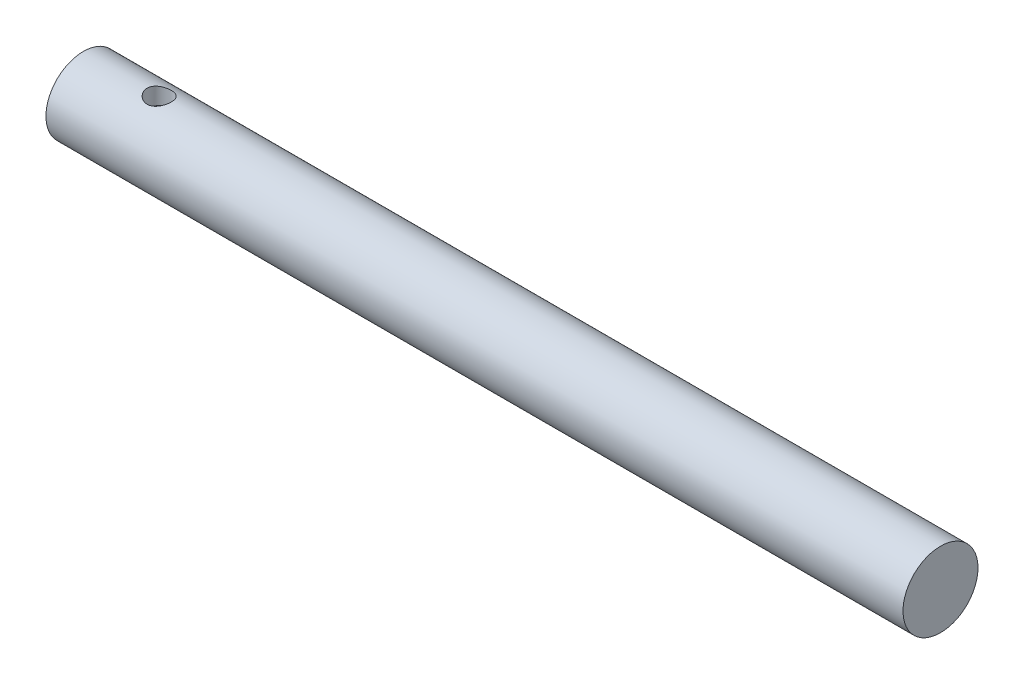
ISO-10303-21;
HEADER;
FILE_DESCRIPTION(('STEP AP214'),'2;1');
FILE_NAME('part.step','',(''),(''),'','','');
FILE_SCHEMA(('AUTOMOTIVE_DESIGN { 1 0 10303 214 1 1 1 1 }'));
ENDSEC;
DATA;
#1=APPLICATION_CONTEXT('core data for automotive mechanical design processes');
#2=APPLICATION_PROTOCOL_DEFINITION('international standard','automotive_design',2000,#1);
#3=PRODUCT_CONTEXT('',#1,'mechanical');
#4=PRODUCT('Part','Part','',(#3));
#5=PRODUCT_RELATED_PRODUCT_CATEGORY('part','',(#4));
#6=PRODUCT_DEFINITION_FORMATION('','',#4);
#7=PRODUCT_DEFINITION_CONTEXT('part definition',#1,'design');
#8=PRODUCT_DEFINITION('design','',#6,#7);
#9=PRODUCT_DEFINITION_SHAPE('','',#8);
#10=(LENGTH_UNIT() NAMED_UNIT(*) SI_UNIT(.MILLI.,.METRE.));
#11=(NAMED_UNIT(*) PLANE_ANGLE_UNIT() SI_UNIT($,.RADIAN.));
#12=(NAMED_UNIT(*) SI_UNIT($,.STERADIAN.) SOLID_ANGLE_UNIT());
#13=UNCERTAINTY_MEASURE_WITH_UNIT(LENGTH_MEASURE(1.E-05),#10,'distance_accuracy_value','');
#14=(GEOMETRIC_REPRESENTATION_CONTEXT(3) GLOBAL_UNCERTAINTY_ASSIGNED_CONTEXT((#13)) GLOBAL_UNIT_ASSIGNED_CONTEXT((#10,
#11,#12)) REPRESENTATION_CONTEXT('',''));
#15=CARTESIAN_POINT('',(0.,0.,0.));
#16=DIRECTION('',(0.,0.,1.));
#17=DIRECTION('',(1.,0.,0.));
#18=AXIS2_PLACEMENT_3D('',#15,#16,#17);
#19=CARTESIAN_POINT('',(71.12,0.,0.));
#20=DIRECTION('',(-1.,0.,0.));
#21=DIRECTION('',(0.,0.,1.));
#22=AXIS2_PLACEMENT_3D('',#19,#20,#21);
#23=CYLINDRICAL_SURFACE('',#22,3.1115);
#24=CARTESIAN_POINT('',(6.28856363377193,2.94642703116843,-1.));
#25=CARTESIAN_POINT('',(6.34315367775352,2.94642717018856,-0.999999880581601));
#26=CARTESIAN_POINT('',(6.39774526324955,2.94796075388296,-0.995514738402349));
#27=CARTESIAN_POINT('',(6.50531892689581,2.95390029986224,-0.977747819684249));
#28=CARTESIAN_POINT('',(6.55830064018965,2.95830690827301,-0.964464064379803));
#29=CARTESIAN_POINT('',(6.6610800479492,2.96944295679219,-0.929608413053124));
#30=CARTESIAN_POINT('',(6.710883431207,2.97616810048008,-0.90805183888401));
#31=CARTESIAN_POINT('',(6.80618163875692,2.9911773789918,-0.857314108506713));
#32=CARTESIAN_POINT('',(6.85167561784252,2.99946181869368,-0.828131460792548));
#33=CARTESIAN_POINT('',(6.93871723131713,3.01699397258492,-0.761833873233638));
#34=CARTESIAN_POINT('',(6.98008525994176,3.02626444308841,-0.724489091650055));
#35=CARTESIAN_POINT('',(7.0560925797304,3.04453102136603,-0.643418590957716));
#36=CARTESIAN_POINT('',(7.09073087384111,3.05352708831933,-0.599691928010366));
#37=CARTESIAN_POINT('',(7.15309738524942,3.07049288024779,-0.505798702368883));
#38=CARTESIAN_POINT('',(7.18063928592378,3.07843270229025,-0.455502503969951));
#39=CARTESIAN_POINT('',(7.22680194419123,3.09212466343625,-0.350692757435096));
#40=CARTESIAN_POINT('',(7.2454249268308,3.09787734810183,-0.296180265104571));
#41=CARTESIAN_POINT('',(7.27261749712343,3.10638574279742,-0.186366991441238));
#42=CARTESIAN_POINT('',(7.28149435637244,3.10923283956774,-0.131149509646918));
#43=CARTESIAN_POINT('',(7.28991770845223,3.11193271467309,-0.0199403580659783));
#44=CARTESIAN_POINT('',(7.28946644102113,3.11178621178912,0.0360511226524476));
#45=CARTESIAN_POINT('',(7.27944545286807,3.10857831369005,0.145051121583793));
#46=CARTESIAN_POINT('',(7.27020909658398,3.10562348794371,0.198093930553713));
#47=CARTESIAN_POINT('',(7.24342890581667,3.09726316478814,0.301832237882419));
#48=CARTESIAN_POINT('',(7.22588451973183,3.09185750465973,0.352527580138608));
#49=CARTESIAN_POINT('',(7.18278038641475,3.0790629368361,0.450884115299431));
#50=CARTESIAN_POINT('',(7.15712213665836,3.07164982664454,0.498498861872665));
#51=CARTESIAN_POINT('',(7.09859851639436,3.05561748880042,0.588848482360886));
#52=CARTESIAN_POINT('',(7.0657312447591,3.04699794321006,0.631582064509975));
#53=CARTESIAN_POINT('',(6.9920241617242,3.02901938073325,0.712942327359244));
#54=CARTESIAN_POINT('',(6.95089743040982,3.01964451366678,0.751305944879454));
#55=CARTESIAN_POINT('',(6.86270961783881,3.00153570693509,0.820672983731542));
#56=CARTESIAN_POINT('',(6.81564775223341,2.99280185222366,0.85167543069507));
#57=CARTESIAN_POINT('',(6.716144653928,2.97688107731568,0.90577013805172));
#58=CARTESIAN_POINT('',(6.66364384383496,2.96971472787707,0.928759319545221));
#59=CARTESIAN_POINT('',(6.55522933248398,2.95798017131937,0.96548517121944));
#60=CARTESIAN_POINT('',(6.49931695106853,2.95341096640611,0.979225395121648));
#61=CARTESIAN_POINT('',(6.38819864820245,2.9476113321464,0.996544059833803));
#62=CARTESIAN_POINT('',(6.33306275532381,2.94624794485703,1.00052746426013));
#63=CARTESIAN_POINT('',(6.22290466563879,2.94664410731836,0.999360597920425));
#64=CARTESIAN_POINT('',(6.16788245151398,2.94840313987039,0.994211839808948));
#65=CARTESIAN_POINT('',(6.06129797212999,2.95471412977537,0.975289571727774));
#66=CARTESIAN_POINT('',(6.00968131875688,2.95917738077124,0.961789718489808));
#67=CARTESIAN_POINT('',(5.90945341104933,2.97029841242403,0.92687272374307));
#68=CARTESIAN_POINT('',(5.86084266683711,2.97695656436262,0.90545424267272));
#69=CARTESIAN_POINT('',(5.7663926417185,2.99196474969366,0.854576381689205));
#70=CARTESIAN_POINT('',(5.72068014756425,3.00035952291692,0.824895178338465));
#71=CARTESIAN_POINT('',(5.63473759497611,3.01780491166552,0.758590166508191));
#72=CARTESIAN_POINT('',(5.59450904717242,3.0268557068539,0.721964451681478));
#73=CARTESIAN_POINT('',(5.51884010021471,3.04507748350012,0.640885235910722));
#74=CARTESIAN_POINT('',(5.48369002791398,3.05423608716214,0.596157246061424));
#75=CARTESIAN_POINT('',(5.42137997706582,3.07124385238374,0.501214391439224));
#76=CARTESIAN_POINT('',(5.3942196625538,3.07909306899627,0.450999757498271));
#77=CARTESIAN_POINT('',(5.34891696955919,3.09255587221059,0.346796288018459));
#78=CARTESIAN_POINT('',(5.33071160959019,3.09818501565846,0.292836948775638));
#79=CARTESIAN_POINT('',(5.30370048676371,3.10664143143312,0.182408004150389));
#80=CARTESIAN_POINT('',(5.29489159471,3.10946963650132,0.125939240981782));
#81=CARTESIAN_POINT('',(5.28718930931211,3.11194008110883,0.0147595840166009));
#82=CARTESIAN_POINT('',(5.28787767916625,3.11171670924495,-0.0399196800315367));
#83=CARTESIAN_POINT('',(5.29813045786026,3.10843476736477,-0.148347704702067));
#84=CARTESIAN_POINT('',(5.30769423015609,3.10537640067437,-0.202096531773813));
#85=CARTESIAN_POINT('',(5.33515507903698,3.09681354603901,-0.306400577743431));
#86=CARTESIAN_POINT('',(5.35293464797351,3.09134359913585,-0.35698976875353));
#87=CARTESIAN_POINT('',(5.39621523799221,3.07852109212276,-0.454489555027578));
#88=CARTESIAN_POINT('',(5.42171761750194,3.07116820084168,-0.501399501290325));
#89=CARTESIAN_POINT('',(5.48075736853444,3.05502053353151,-0.59200950284486));
#90=CARTESIAN_POINT('',(5.51454623201199,3.04618407537141,-0.635538176536333));
#91=CARTESIAN_POINT('',(5.58876294521348,3.02817751779764,-0.71644563901011));
#92=CARTESIAN_POINT('',(5.62919283670728,3.01900731645241,-0.753822529342273));
#93=CARTESIAN_POINT('',(5.71726866936342,3.00098148536631,-0.822713404402636));
#94=CARTESIAN_POINT('',(5.76512037622511,2.99214870166322,-0.853971076465209));
#95=CARTESIAN_POINT('',(5.86566763151587,2.97620844199893,-0.907971603383714));
#96=CARTESIAN_POINT('',(5.91836149584163,2.96910036929071,-0.930717404813503));
#97=CARTESIAN_POINT('',(6.02339600948357,2.95790645023686,-0.965679346504214));
#98=CARTESIAN_POINT('',(6.07551365113268,2.95364694912531,-0.97850998569522));
#99=CARTESIAN_POINT('',(6.18127520292296,2.94790756702689,-0.995669160641774));
#100=CARTESIAN_POINT('',(6.23491867404652,2.94642689455507,-1.00000011735098));
#101=CARTESIAN_POINT('',(6.28856363377193,2.94642703116843,-1.));
#102=B_SPLINE_CURVE_WITH_KNOTS('',3,(#24,#25,#26,#27,#28,#29,#30,#31,#32,#33,#34,#35,#36,#37,
#38,#39,#40,#41,#42,#43,#44,#45,#46,#47,#48,#49,#50,#51,#52,#53,#54,#55,#56,#57,#58,#59,#60,#61,
#62,#63,#64,#65,#66,#67,#68,#69,#70,#71,#72,#73,#74,#75,#76,#77,#78,#79,#80,#81,#82,#83,#84,#85,
#86,#87,#88,#89,#90,#91,#92,#93,#94,#95,#96,#97,#98,#99,#100,#101),.UNSPECIFIED.,.T.,.F.,(4,2,2,
2,2,2,2,2,2,2,2,2,2,2,2,2,2,2,2,2,2,2,2,2,2,2,2,2,2,2,2,2,2,2,2,2,2,2,4),(0.,0.163571764334325,
0.327180327664523,0.490487327257123,0.653826290336488,0.822551523640768,0.991301735638956,
1.16411224762546,1.33687962523476,1.50402802284327,1.67113628760398,1.83214620195508,
1.99316680786433,2.15622253174728,2.31932130769205,2.48958870143957,2.65987862024429,
2.83228456106449,3.00462422058206,3.16967955316795,3.33470754848474,3.4945949262579,
3.65450936390385,3.81921823116754,3.98397237851675,4.15601060552586,4.32804159739473,
4.49884472562338,4.66959095550114,4.83284286412876,4.99608306523098,5.15705751356271,
5.31806029345404,5.48473704774672,5.65146514269701,5.82413312399683,5.99674127700885,
6.15752702584152,6.3182669716252),.UNSPECIFIED.);
#103=CARTESIAN_POINT('',(6.28856363377193,2.94642703116843,-1.));
#104=VERTEX_POINT('',#103);
#105=EDGE_CURVE('E82',#104,#104,#102,.T.);
#106=ORIENTED_EDGE('',*,*,#105,.T.);
#107=EDGE_LOOP('',(#106));
#108=FACE_BOUND('',#107,.T.);
#109=CARTESIAN_POINT('',(71.12,0.,0.));
#110=DIRECTION('',(1.,0.,0.));
#111=DIRECTION('',(0.,0.,-1.));
#112=AXIS2_PLACEMENT_3D('',#109,#110,#111);
#113=CIRCLE('',#112,3.1115);
#114=CARTESIAN_POINT('',(71.12,0.,-3.1115));
#115=VERTEX_POINT('',#114);
#116=EDGE_CURVE('E11',#115,#115,#113,.T.);
#117=ORIENTED_EDGE('',*,*,#116,.F.);
#118=EDGE_LOOP('',(#117));
#119=FACE_BOUND('',#118,.T.);
#120=CARTESIAN_POINT('',(0.,0.,0.));
#121=DIRECTION('',(1.,0.,0.));
#122=DIRECTION('',(0.,0.,-1.));
#123=AXIS2_PLACEMENT_3D('',#120,#121,#122);
#124=CIRCLE('',#123,3.1115);
#125=CARTESIAN_POINT('',(0.,0.,-3.1115));
#126=VERTEX_POINT('',#125);
#127=EDGE_CURVE('E42',#126,#126,#124,.T.);
#128=ORIENTED_EDGE('',*,*,#127,.T.);
#129=EDGE_LOOP('',(#128));
#130=FACE_BOUND('',#129,.T.);
#131=ADVANCED_FACE('F38',(#108,#119,#130),#23,.T.);
#132=CARTESIAN_POINT('',(71.12,0.,0.));
#133=DIRECTION('',(1.,0.,0.));
#134=DIRECTION('',(0.,0.,-1.));
#135=AXIS2_PLACEMENT_3D('',#132,#133,#134);
#136=PLANE('',#135);
#137=ORIENTED_EDGE('',*,*,#116,.T.);
#138=EDGE_LOOP('',(#137));
#139=FACE_BOUND('',#138,.T.);
#140=ADVANCED_FACE('F114',(#139),#136,.T.);
#141=CARTESIAN_POINT('',(0.,0.,0.));
#142=DIRECTION('',(1.,0.,0.));
#143=DIRECTION('',(0.,0.,-1.));
#144=AXIS2_PLACEMENT_3D('',#141,#142,#143);
#145=PLANE('',#144);
#146=DIRECTION('',(0.,0.,-1.));
#147=VECTOR('',#146,1.);
#148=CARTESIAN_POINT('',(0.,1.651,-1.15159311499331));
#149=LINE('',#148,#147);
#150=CARTESIAN_POINT('',(0.,1.651,1.15159311499331));
#151=VERTEX_POINT('',#150);
#152=CARTESIAN_POINT('',(0.,1.651,-1.15159311499331));
#153=VERTEX_POINT('',#152);
#154=EDGE_CURVE('E74',#151,#153,#149,.T.);
#155=ORIENTED_EDGE('',*,*,#154,.F.);
#156=CARTESIAN_POINT('',(0.,0.,0.));
#157=DIRECTION('',(-1.,0.,0.));
#158=DIRECTION('',(0.,0.,1.));
#159=AXIS2_PLACEMENT_3D('',#156,#157,#158);
#160=CIRCLE('',#159,2.01295);
#161=EDGE_CURVE('E54',#153,#151,#160,.T.);
#162=ORIENTED_EDGE('',*,*,#161,.F.);
#163=EDGE_LOOP('',(#155,#162));
#164=FACE_BOUND('',#163,.T.);
#165=ORIENTED_EDGE('',*,*,#127,.F.);
#166=EDGE_LOOP('',(#165));
#167=FACE_BOUND('',#166,.T.);
#168=ADVANCED_FACE('F79',(#164,#167),#145,.F.);
#169=CARTESIAN_POINT('',(12.,0.,0.));
#170=DIRECTION('',(-1.,0.,0.));
#171=DIRECTION('',(0.,0.,1.));
#172=AXIS2_PLACEMENT_3D('',#169,#170,#171);
#173=CYLINDRICAL_SURFACE('',#172,2.01295);
#174=ORIENTED_EDGE('',*,*,#161,.T.);
#175=DIRECTION('',(-1.,0.,0.));
#176=VECTOR('',#175,1.);
#177=CARTESIAN_POINT('',(12.,1.651,1.15159311499331));
#178=LINE('',#177,#176);
#179=CARTESIAN_POINT('',(12.,1.651,1.15159311499331));
#180=VERTEX_POINT('',#179);
#181=EDGE_CURVE('E71',#180,#151,#178,.T.);
#182=ORIENTED_EDGE('',*,*,#181,.F.);
#183=CARTESIAN_POINT('',(12.,0.,0.));
#184=DIRECTION('',(-1.,0.,0.));
#185=DIRECTION('',(0.,0.,1.));
#186=AXIS2_PLACEMENT_3D('',#183,#184,#185);
#187=CIRCLE('',#186,2.01295);
#188=CARTESIAN_POINT('',(12.,1.651,-1.15159311499331));
#189=VERTEX_POINT('',#188);
#190=EDGE_CURVE('E68',#189,#180,#187,.T.);
#191=ORIENTED_EDGE('',*,*,#190,.F.);
#192=DIRECTION('',(-1.,0.,0.));
#193=VECTOR('',#192,1.);
#194=CARTESIAN_POINT('',(12.,1.651,-1.15159311499331));
#195=LINE('',#194,#193);
#196=EDGE_CURVE('E62',#189,#153,#195,.T.);
#197=ORIENTED_EDGE('',*,*,#196,.T.);
#198=EDGE_LOOP('',(#174,#182,#191,#197));
#199=FACE_BOUND('',#198,.T.);
#200=ADVANCED_FACE('F66',(#199),#173,.F.);
#201=CARTESIAN_POINT('',(12.,1.651,-1.15159311499331));
#202=DIRECTION('',(0.,1.,0.));
#203=DIRECTION('',(0.,0.,1.));
#204=AXIS2_PLACEMENT_3D('',#201,#202,#203);
#205=PLANE('',#204);
#206=CARTESIAN_POINT('',(6.28856363377193,1.651,0.));
#207=DIRECTION('',(0.,-1.,0.));
#208=DIRECTION('',(0.,0.,-1.));
#209=AXIS2_PLACEMENT_3D('',#206,#207,#208);
#210=CIRCLE('',#209,1.);
#211=CARTESIAN_POINT('',(6.28856363377193,1.651,-1.));
#212=VERTEX_POINT('',#211);
#213=EDGE_CURVE('E86',#212,#212,#210,.T.);
#214=ORIENTED_EDGE('',*,*,#213,.F.);
#215=EDGE_LOOP('',(#214));
#216=FACE_BOUND('',#215,.T.);
#217=ORIENTED_EDGE('',*,*,#154,.T.);
#218=ORIENTED_EDGE('',*,*,#196,.F.);
#219=DIRECTION('',(0.,0.,-1.));
#220=VECTOR('',#219,1.);
#221=CARTESIAN_POINT('',(12.,1.651,-1.15159311499331));
#222=LINE('',#221,#220);
#223=EDGE_CURVE('E89',#180,#189,#222,.T.);
#224=ORIENTED_EDGE('',*,*,#223,.F.);
#225=ORIENTED_EDGE('',*,*,#181,.T.);
#226=EDGE_LOOP('',(#217,#218,#224,#225));
#227=FACE_BOUND('',#226,.T.);
#228=ADVANCED_FACE('F75',(#216,#227),#205,.F.);
#229=CARTESIAN_POINT('',(12.,0.,0.));
#230=DIRECTION('',(-1.,0.,0.));
#231=DIRECTION('',(0.,0.,1.));
#232=AXIS2_PLACEMENT_3D('',#229,#230,#231);
#233=PLANE('',#232);
#234=ORIENTED_EDGE('',*,*,#190,.T.);
#235=ORIENTED_EDGE('',*,*,#223,.T.);
#236=EDGE_LOOP('',(#234,#235));
#237=FACE_BOUND('',#236,.T.);
#238=ADVANCED_FACE('F105',(#237),#233,.T.);
#239=CARTESIAN_POINT('',(6.28856363377193,4.191,0.));
#240=DIRECTION('',(0.,-1.,0.));
#241=DIRECTION('',(0.,0.,-1.));
#242=AXIS2_PLACEMENT_3D('',#239,#240,#241);
#243=CYLINDRICAL_SURFACE('',#242,1.);
#244=ORIENTED_EDGE('',*,*,#213,.T.);
#245=EDGE_LOOP('',(#244));
#246=FACE_BOUND('',#245,.T.);
#247=ORIENTED_EDGE('',*,*,#105,.F.);
#248=EDGE_LOOP('',(#247));
#249=FACE_BOUND('',#248,.T.);
#250=ADVANCED_FACE('F101',(#246,#249),#243,.F.);
#251=CLOSED_SHELL('',(#131,#140,#168,#200,#228,#238,#250));
#252=MANIFOLD_SOLID_BREP('B2',#251);
#253=ADVANCED_BREP_SHAPE_REPRESENTATION('',(#18,#252),#14);
#254=SHAPE_DEFINITION_REPRESENTATION(#9,#253);
ENDSEC;
END-ISO-10303-21;
